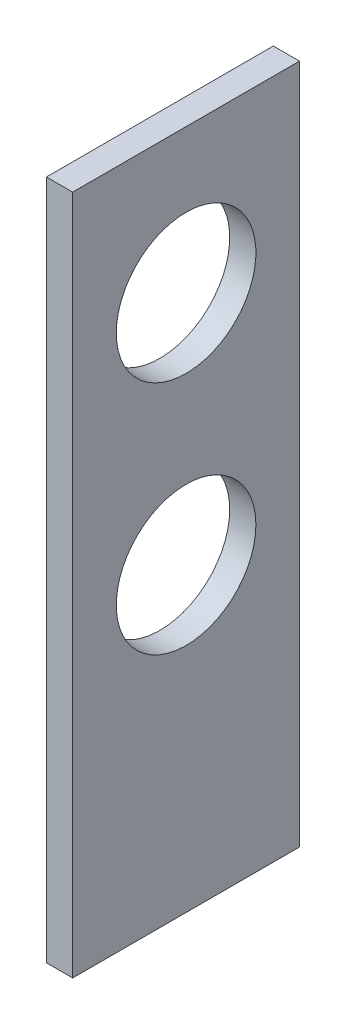
ISO-10303-21;
HEADER;
FILE_DESCRIPTION(('STEP AP214'),'2;1');
FILE_NAME('part.step','',(''),(''),'','','');
FILE_SCHEMA(('AUTOMOTIVE_DESIGN { 1 0 10303 214 1 1 1 1 }'));
ENDSEC;
DATA;
#1=APPLICATION_CONTEXT('core data for automotive mechanical design processes');
#2=APPLICATION_PROTOCOL_DEFINITION('international standard','automotive_design',2000,#1);
#3=PRODUCT_CONTEXT('',#1,'mechanical');
#4=PRODUCT('Part','Part','',(#3));
#5=PRODUCT_RELATED_PRODUCT_CATEGORY('part','',(#4));
#6=PRODUCT_DEFINITION_FORMATION('','',#4);
#7=PRODUCT_DEFINITION_CONTEXT('part definition',#1,'design');
#8=PRODUCT_DEFINITION('design','',#6,#7);
#9=PRODUCT_DEFINITION_SHAPE('','',#8);
#10=(LENGTH_UNIT() NAMED_UNIT(*) SI_UNIT(.MILLI.,.METRE.));
#11=(NAMED_UNIT(*) PLANE_ANGLE_UNIT() SI_UNIT($,.RADIAN.));
#12=(NAMED_UNIT(*) SI_UNIT($,.STERADIAN.) SOLID_ANGLE_UNIT());
#13=UNCERTAINTY_MEASURE_WITH_UNIT(LENGTH_MEASURE(1.E-05),#10,'distance_accuracy_value','');
#14=(GEOMETRIC_REPRESENTATION_CONTEXT(3) GLOBAL_UNCERTAINTY_ASSIGNED_CONTEXT((#13)) GLOBAL_UNIT_ASSIGNED_CONTEXT((#10,
#11,#12)) REPRESENTATION_CONTEXT('',''));
#15=CARTESIAN_POINT('',(0.,0.,0.));
#16=DIRECTION('',(0.,0.,1.));
#17=DIRECTION('',(1.,0.,0.));
#18=AXIS2_PLACEMENT_3D('',#15,#16,#17);
#19=CARTESIAN_POINT('',(3.,0.,0.));
#20=DIRECTION('',(0.,0.,1.));
#21=DIRECTION('',(1.,0.,0.));
#22=AXIS2_PLACEMENT_3D('',#19,#20,#21);
#23=PLANE('',#22);
#24=DIRECTION('',(0.,1.,0.));
#25=VECTOR('',#24,1.);
#26=CARTESIAN_POINT('',(0.,0.,0.));
#27=LINE('',#26,#25);
#28=CARTESIAN_POINT('',(0.,0.,0.));
#29=VERTEX_POINT('',#28);
#30=CARTESIAN_POINT('',(0.,78.,0.));
#31=VERTEX_POINT('',#30);
#32=EDGE_CURVE('E98',#29,#31,#27,.T.);
#33=ORIENTED_EDGE('',*,*,#32,.T.);
#34=DIRECTION('',(-1.,0.,0.));
#35=VECTOR('',#34,1.);
#36=CARTESIAN_POINT('',(3.,78.,0.));
#37=LINE('',#36,#35);
#38=CARTESIAN_POINT('',(3.,78.,0.));
#39=VERTEX_POINT('',#38);
#40=EDGE_CURVE('E11',#39,#31,#37,.T.);
#41=ORIENTED_EDGE('',*,*,#40,.F.);
#42=DIRECTION('',(0.,1.,0.));
#43=VECTOR('',#42,1.);
#44=CARTESIAN_POINT('',(3.,0.,0.));
#45=LINE('',#44,#43);
#46=CARTESIAN_POINT('',(3.,0.,0.));
#47=VERTEX_POINT('',#46);
#48=EDGE_CURVE('E86',#47,#39,#45,.T.);
#49=ORIENTED_EDGE('',*,*,#48,.F.);
#50=DIRECTION('',(-1.,0.,0.));
#51=VECTOR('',#50,1.);
#52=CARTESIAN_POINT('',(3.,0.,0.));
#53=LINE('',#52,#51);
#54=EDGE_CURVE('E94',#47,#29,#53,.T.);
#55=ORIENTED_EDGE('',*,*,#54,.T.);
#56=EDGE_LOOP('',(#33,#41,#49,#55));
#57=FACE_BOUND('',#56,.T.);
#58=ADVANCED_FACE('F35',(#57),#23,.F.);
#59=CARTESIAN_POINT('',(3.,78.,0.));
#60=DIRECTION('',(0.,-1.,0.));
#61=DIRECTION('',(0.,0.,-1.));
#62=AXIS2_PLACEMENT_3D('',#59,#60,#61);
#63=PLANE('',#62);
#64=DIRECTION('',(0.,0.,1.));
#65=VECTOR('',#64,1.);
#66=CARTESIAN_POINT('',(0.,78.,0.));
#67=LINE('',#66,#65);
#68=CARTESIAN_POINT('',(0.,78.,26.));
#69=VERTEX_POINT('',#68);
#70=EDGE_CURVE('E90',#31,#69,#67,.T.);
#71=ORIENTED_EDGE('',*,*,#70,.T.);
#72=DIRECTION('',(-1.,0.,0.));
#73=VECTOR('',#72,1.);
#74=CARTESIAN_POINT('',(3.,78.,26.));
#75=LINE('',#74,#73);
#76=CARTESIAN_POINT('',(3.,78.,26.));
#77=VERTEX_POINT('',#76);
#78=EDGE_CURVE('E43',#77,#69,#75,.T.);
#79=ORIENTED_EDGE('',*,*,#78,.F.);
#80=DIRECTION('',(0.,0.,1.));
#81=VECTOR('',#80,1.);
#82=CARTESIAN_POINT('',(3.,78.,0.));
#83=LINE('',#82,#81);
#84=EDGE_CURVE('E81',#39,#77,#83,.T.);
#85=ORIENTED_EDGE('',*,*,#84,.F.);
#86=ORIENTED_EDGE('',*,*,#40,.T.);
#87=EDGE_LOOP('',(#71,#79,#85,#86));
#88=FACE_BOUND('',#87,.T.);
#89=ADVANCED_FACE('F89',(#88),#63,.F.);
#90=CARTESIAN_POINT('',(3.,0.,26.));
#91=DIRECTION('',(0.,0.,-1.));
#92=DIRECTION('',(-1.,0.,0.));
#93=AXIS2_PLACEMENT_3D('',#90,#91,#92);
#94=PLANE('',#93);
#95=DIRECTION('',(0.,-1.,0.));
#96=VECTOR('',#95,1.);
#97=CARTESIAN_POINT('',(0.,0.,26.));
#98=LINE('',#97,#96);
#99=CARTESIAN_POINT('',(0.,0.,26.));
#100=VERTEX_POINT('',#99);
#101=EDGE_CURVE('E68',#69,#100,#98,.T.);
#102=ORIENTED_EDGE('',*,*,#101,.T.);
#103=DIRECTION('',(-1.,0.,0.));
#104=VECTOR('',#103,1.);
#105=CARTESIAN_POINT('',(3.,0.,26.));
#106=LINE('',#105,#104);
#107=CARTESIAN_POINT('',(3.,0.,26.));
#108=VERTEX_POINT('',#107);
#109=EDGE_CURVE('E91',#108,#100,#106,.T.);
#110=ORIENTED_EDGE('',*,*,#109,.F.);
#111=DIRECTION('',(0.,-1.,0.));
#112=VECTOR('',#111,1.);
#113=CARTESIAN_POINT('',(3.,0.,26.));
#114=LINE('',#113,#112);
#115=EDGE_CURVE('E84',#77,#108,#114,.T.);
#116=ORIENTED_EDGE('',*,*,#115,.F.);
#117=ORIENTED_EDGE('',*,*,#78,.T.);
#118=EDGE_LOOP('',(#102,#110,#116,#117));
#119=FACE_BOUND('',#118,.T.);
#120=ADVANCED_FACE('F92',(#119),#94,.F.);
#121=CARTESIAN_POINT('',(3.,0.,0.));
#122=DIRECTION('',(0.,1.,0.));
#123=DIRECTION('',(0.,0.,1.));
#124=AXIS2_PLACEMENT_3D('',#121,#122,#123);
#125=PLANE('',#124);
#126=DIRECTION('',(0.,0.,-1.));
#127=VECTOR('',#126,1.);
#128=CARTESIAN_POINT('',(0.,0.,0.));
#129=LINE('',#128,#127);
#130=EDGE_CURVE('E74',#100,#29,#129,.T.);
#131=ORIENTED_EDGE('',*,*,#130,.T.);
#132=ORIENTED_EDGE('',*,*,#54,.F.);
#133=DIRECTION('',(0.,0.,-1.));
#134=VECTOR('',#133,1.);
#135=CARTESIAN_POINT('',(3.,0.,0.));
#136=LINE('',#135,#134);
#137=EDGE_CURVE('E51',#108,#47,#136,.T.);
#138=ORIENTED_EDGE('',*,*,#137,.F.);
#139=ORIENTED_EDGE('',*,*,#109,.T.);
#140=EDGE_LOOP('',(#131,#132,#138,#139));
#141=FACE_BOUND('',#140,.T.);
#142=ADVANCED_FACE('F106',(#141),#125,.F.);
#143=CARTESIAN_POINT('',(3.,0.,0.));
#144=DIRECTION('',(1.,0.,0.));
#145=DIRECTION('',(0.,0.,-1.));
#146=AXIS2_PLACEMENT_3D('',#143,#144,#145);
#147=PLANE('',#146);
#148=CARTESIAN_POINT('',(3.,34.5,13.));
#149=DIRECTION('',(-1.,0.,0.));
#150=DIRECTION('',(0.,0.,-1.));
#151=AXIS2_PLACEMENT_3D('',#148,#149,#150);
#152=CIRCLE('',#151,8.);
#153=CARTESIAN_POINT('',(3.,34.5,4.99999999999999));
#154=VERTEX_POINT('',#153);
#155=EDGE_CURVE('E115',#154,#154,#152,.T.);
#156=ORIENTED_EDGE('',*,*,#155,.T.);
#157=EDGE_LOOP('',(#156));
#158=FACE_BOUND('',#157,.T.);
#159=CARTESIAN_POINT('',(3.,61.5,13.));
#160=DIRECTION('',(-1.,0.,0.));
#161=DIRECTION('',(0.,0.,1.));
#162=AXIS2_PLACEMENT_3D('',#159,#160,#161);
#163=CIRCLE('',#162,8.00000000000001);
#164=CARTESIAN_POINT('',(3.,61.5,21.));
#165=VERTEX_POINT('',#164);
#166=EDGE_CURVE('E101',#165,#165,#163,.T.);
#167=ORIENTED_EDGE('',*,*,#166,.T.);
#168=EDGE_LOOP('',(#167));
#169=FACE_BOUND('',#168,.T.);
#170=ORIENTED_EDGE('',*,*,#48,.T.);
#171=ORIENTED_EDGE('',*,*,#84,.T.);
#172=ORIENTED_EDGE('',*,*,#115,.T.);
#173=ORIENTED_EDGE('',*,*,#137,.T.);
#174=EDGE_LOOP('',(#170,#171,#172,#173));
#175=FACE_BOUND('',#174,.T.);
#176=ADVANCED_FACE('F82',(#158,#169,#175),#147,.T.);
#177=CARTESIAN_POINT('',(0.,0.,0.));
#178=DIRECTION('',(1.,0.,0.));
#179=DIRECTION('',(0.,0.,-1.));
#180=AXIS2_PLACEMENT_3D('',#177,#178,#179);
#181=PLANE('',#180);
#182=CARTESIAN_POINT('',(0.,34.5,13.));
#183=DIRECTION('',(-1.,0.,0.));
#184=DIRECTION('',(0.,0.,-1.));
#185=AXIS2_PLACEMENT_3D('',#182,#183,#184);
#186=CIRCLE('',#185,8.);
#187=CARTESIAN_POINT('',(0.,34.5,4.99999999999999));
#188=VERTEX_POINT('',#187);
#189=EDGE_CURVE('E118',#188,#188,#186,.T.);
#190=ORIENTED_EDGE('',*,*,#189,.F.);
#191=EDGE_LOOP('',(#190));
#192=FACE_BOUND('',#191,.T.);
#193=CARTESIAN_POINT('',(0.,61.5,13.));
#194=DIRECTION('',(-1.,0.,0.));
#195=DIRECTION('',(0.,0.,1.));
#196=AXIS2_PLACEMENT_3D('',#193,#194,#195);
#197=CIRCLE('',#196,8.00000000000001);
#198=CARTESIAN_POINT('',(0.,61.5,21.));
#199=VERTEX_POINT('',#198);
#200=EDGE_CURVE('E112',#199,#199,#197,.T.);
#201=ORIENTED_EDGE('',*,*,#200,.F.);
#202=EDGE_LOOP('',(#201));
#203=FACE_BOUND('',#202,.T.);
#204=ORIENTED_EDGE('',*,*,#32,.F.);
#205=ORIENTED_EDGE('',*,*,#130,.F.);
#206=ORIENTED_EDGE('',*,*,#101,.F.);
#207=ORIENTED_EDGE('',*,*,#70,.F.);
#208=EDGE_LOOP('',(#204,#205,#206,#207));
#209=FACE_BOUND('',#208,.T.);
#210=ADVANCED_FACE('F109',(#192,#203,#209),#181,.F.);
#211=CARTESIAN_POINT('',(3.,61.5,13.));
#212=DIRECTION('',(-1.,0.,0.));
#213=DIRECTION('',(0.,0.,1.));
#214=AXIS2_PLACEMENT_3D('',#211,#212,#213);
#215=CYLINDRICAL_SURFACE('',#214,8.00000000000001);
#216=ORIENTED_EDGE('',*,*,#166,.F.);
#217=EDGE_LOOP('',(#216));
#218=FACE_BOUND('',#217,.T.);
#219=ORIENTED_EDGE('',*,*,#200,.T.);
#220=EDGE_LOOP('',(#219));
#221=FACE_BOUND('',#220,.T.);
#222=ADVANCED_FACE('F129',(#218,#221),#215,.F.);
#223=CARTESIAN_POINT('',(3.,34.5,13.));
#224=DIRECTION('',(-1.,0.,0.));
#225=DIRECTION('',(0.,0.,1.));
#226=AXIS2_PLACEMENT_3D('',#223,#224,#225);
#227=CYLINDRICAL_SURFACE('',#226,8.);
#228=ORIENTED_EDGE('',*,*,#155,.F.);
#229=EDGE_LOOP('',(#228));
#230=FACE_BOUND('',#229,.T.);
#231=ORIENTED_EDGE('',*,*,#189,.T.);
#232=EDGE_LOOP('',(#231));
#233=FACE_BOUND('',#232,.T.);
#234=ADVANCED_FACE('F126',(#230,#233),#227,.F.);
#235=CLOSED_SHELL('',(#58,#89,#120,#142,#176,#210,#222,#234));
#236=MANIFOLD_SOLID_BREP('B2',#235);
#237=ADVANCED_BREP_SHAPE_REPRESENTATION('',(#18,#236),#14);
#238=SHAPE_DEFINITION_REPRESENTATION(#9,#237);
ENDSEC;
END-ISO-10303-21;
